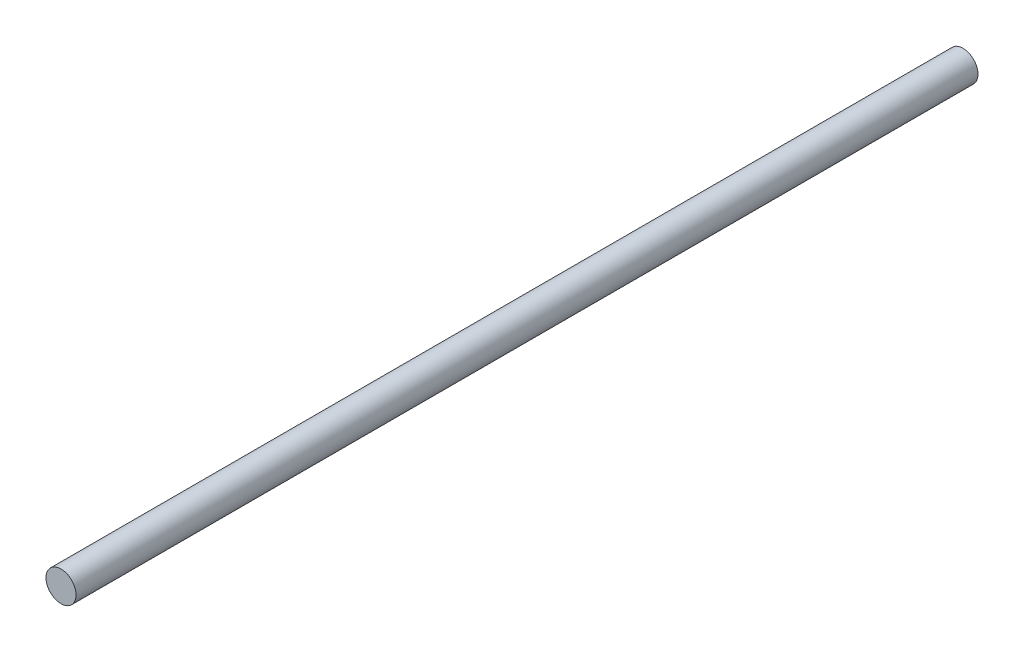
ISO-10303-21;
HEADER;
FILE_DESCRIPTION(('STEP AP214'),'2;1');
FILE_NAME('part.step','',(''),(''),'','','');
FILE_SCHEMA(('AUTOMOTIVE_DESIGN { 1 0 10303 214 1 1 1 1 }'));
ENDSEC;
DATA;
#1=APPLICATION_CONTEXT('core data for automotive mechanical design processes');
#2=APPLICATION_PROTOCOL_DEFINITION('international standard','automotive_design',2000,#1);
#3=PRODUCT_CONTEXT('',#1,'mechanical');
#4=PRODUCT('Part','Part','',(#3));
#5=PRODUCT_RELATED_PRODUCT_CATEGORY('part','',(#4));
#6=PRODUCT_DEFINITION_FORMATION('','',#4);
#7=PRODUCT_DEFINITION_CONTEXT('part definition',#1,'design');
#8=PRODUCT_DEFINITION('design','',#6,#7);
#9=PRODUCT_DEFINITION_SHAPE('','',#8);
#10=(LENGTH_UNIT() NAMED_UNIT(*) SI_UNIT(.MILLI.,.METRE.));
#11=(NAMED_UNIT(*) PLANE_ANGLE_UNIT() SI_UNIT($,.RADIAN.));
#12=(NAMED_UNIT(*) SI_UNIT($,.STERADIAN.) SOLID_ANGLE_UNIT());
#13=UNCERTAINTY_MEASURE_WITH_UNIT(LENGTH_MEASURE(1.E-05),#10,'distance_accuracy_value','');
#14=(GEOMETRIC_REPRESENTATION_CONTEXT(3) GLOBAL_UNCERTAINTY_ASSIGNED_CONTEXT((#13)) GLOBAL_UNIT_ASSIGNED_CONTEXT((#10,
#11,#12)) REPRESENTATION_CONTEXT('',''));
#15=CARTESIAN_POINT('',(0.,0.,0.));
#16=DIRECTION('',(0.,0.,1.));
#17=DIRECTION('',(1.,0.,0.));
#18=AXIS2_PLACEMENT_3D('',#15,#16,#17);
#19=CARTESIAN_POINT('',(0.,0.,60.));
#20=DIRECTION('',(0.,0.,-1.));
#21=DIRECTION('',(-1.,0.,0.));
#22=AXIS2_PLACEMENT_3D('',#19,#20,#21);
#23=CYLINDRICAL_SURFACE('',#22,1.);
#24=CARTESIAN_POINT('',(0.,0.,60.));
#25=DIRECTION('',(0.,0.,1.));
#26=DIRECTION('',(1.,0.,0.));
#27=AXIS2_PLACEMENT_3D('',#24,#25,#26);
#28=CIRCLE('',#27,1.);
#29=CARTESIAN_POINT('',(1.,0.,60.));
#30=VERTEX_POINT('',#29);
#31=EDGE_CURVE('E10',#30,#30,#28,.T.);
#32=ORIENTED_EDGE('',*,*,#31,.F.);
#33=EDGE_LOOP('',(#32));
#34=FACE_BOUND('',#33,.T.);
#35=CARTESIAN_POINT('',(0.,0.,0.));
#36=DIRECTION('',(0.,0.,1.));
#37=DIRECTION('',(1.,0.,0.));
#38=AXIS2_PLACEMENT_3D('',#35,#36,#37);
#39=CIRCLE('',#38,1.);
#40=CARTESIAN_POINT('',(1.,0.,0.));
#41=VERTEX_POINT('',#40);
#42=EDGE_CURVE('E33',#41,#41,#39,.T.);
#43=ORIENTED_EDGE('',*,*,#42,.T.);
#44=EDGE_LOOP('',(#43));
#45=FACE_BOUND('',#44,.T.);
#46=ADVANCED_FACE('F30',(#34,#45),#23,.T.);
#47=CARTESIAN_POINT('',(0.,0.,60.));
#48=DIRECTION('',(0.,0.,1.));
#49=DIRECTION('',(1.,0.,0.));
#50=AXIS2_PLACEMENT_3D('',#47,#48,#49);
#51=PLANE('',#50);
#52=ORIENTED_EDGE('',*,*,#31,.T.);
#53=EDGE_LOOP('',(#52));
#54=FACE_BOUND('',#53,.T.);
#55=ADVANCED_FACE('F45',(#54),#51,.T.);
#56=CARTESIAN_POINT('',(0.,0.,0.));
#57=DIRECTION('',(0.,0.,1.));
#58=DIRECTION('',(1.,0.,0.));
#59=AXIS2_PLACEMENT_3D('',#56,#57,#58);
#60=PLANE('',#59);
#61=ORIENTED_EDGE('',*,*,#42,.F.);
#62=EDGE_LOOP('',(#61));
#63=FACE_BOUND('',#62,.T.);
#64=ADVANCED_FACE('F43',(#63),#60,.F.);
#65=CLOSED_SHELL('',(#46,#55,#64));
#66=MANIFOLD_SOLID_BREP('B2',#65);
#67=ADVANCED_BREP_SHAPE_REPRESENTATION('',(#18,#66),#14);
#68=SHAPE_DEFINITION_REPRESENTATION(#9,#67);
ENDSEC;
END-ISO-10303-21;
